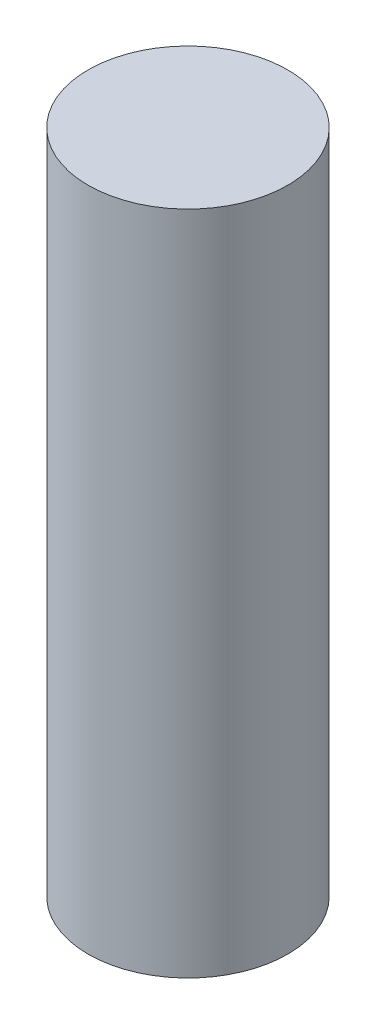
ISO-10303-21;
HEADER;
FILE_DESCRIPTION(('STEP AP214'),'2;1');
FILE_NAME('part.step','',(''),(''),'','','');
FILE_SCHEMA(('AUTOMOTIVE_DESIGN { 1 0 10303 214 1 1 1 1 }'));
ENDSEC;
DATA;
#1=APPLICATION_CONTEXT('core data for automotive mechanical design processes');
#2=APPLICATION_PROTOCOL_DEFINITION('international standard','automotive_design',2000,#1);
#3=PRODUCT_CONTEXT('',#1,'mechanical');
#4=PRODUCT('Part','Part','',(#3));
#5=PRODUCT_RELATED_PRODUCT_CATEGORY('part','',(#4));
#6=PRODUCT_DEFINITION_FORMATION('','',#4);
#7=PRODUCT_DEFINITION_CONTEXT('part definition',#1,'design');
#8=PRODUCT_DEFINITION('design','',#6,#7);
#9=PRODUCT_DEFINITION_SHAPE('','',#8);
#10=(LENGTH_UNIT() NAMED_UNIT(*) SI_UNIT(.MILLI.,.METRE.));
#11=(NAMED_UNIT(*) PLANE_ANGLE_UNIT() SI_UNIT($,.RADIAN.));
#12=(NAMED_UNIT(*) SI_UNIT($,.STERADIAN.) SOLID_ANGLE_UNIT());
#13=UNCERTAINTY_MEASURE_WITH_UNIT(LENGTH_MEASURE(1.E-05),#10,'distance_accuracy_value','');
#14=(GEOMETRIC_REPRESENTATION_CONTEXT(3) GLOBAL_UNCERTAINTY_ASSIGNED_CONTEXT((#13)) GLOBAL_UNIT_ASSIGNED_CONTEXT((#10,
#11,#12)) REPRESENTATION_CONTEXT('',''));
#15=CARTESIAN_POINT('',(0.,0.,0.));
#16=DIRECTION('',(0.,0.,1.));
#17=DIRECTION('',(1.,0.,0.));
#18=AXIS2_PLACEMENT_3D('',#15,#16,#17);
#19=CARTESIAN_POINT('',(0.,5.,0.));
#20=DIRECTION('',(0.,-1.,0.));
#21=DIRECTION('',(0.,0.,-1.));
#22=AXIS2_PLACEMENT_3D('',#19,#20,#21);
#23=CYLINDRICAL_SURFACE('',#22,0.75);
#24=CARTESIAN_POINT('',(0.,5.,0.));
#25=DIRECTION('',(0.,1.,0.));
#26=DIRECTION('',(0.,0.,1.));
#27=AXIS2_PLACEMENT_3D('',#24,#25,#26);
#28=CIRCLE('',#27,0.75);
#29=CARTESIAN_POINT('',(0.,5.,0.75));
#30=VERTEX_POINT('',#29);
#31=EDGE_CURVE('E10',#30,#30,#28,.T.);
#32=ORIENTED_EDGE('',*,*,#31,.F.);
#33=EDGE_LOOP('',(#32));
#34=FACE_BOUND('',#33,.T.);
#35=CARTESIAN_POINT('',(0.,0.,0.));
#36=DIRECTION('',(0.,1.,0.));
#37=DIRECTION('',(0.,0.,1.));
#38=AXIS2_PLACEMENT_3D('',#35,#36,#37);
#39=CIRCLE('',#38,0.75);
#40=CARTESIAN_POINT('',(0.,0.,0.75));
#41=VERTEX_POINT('',#40);
#42=EDGE_CURVE('E33',#41,#41,#39,.T.);
#43=ORIENTED_EDGE('',*,*,#42,.T.);
#44=EDGE_LOOP('',(#43));
#45=FACE_BOUND('',#44,.T.);
#46=ADVANCED_FACE('F30',(#34,#45),#23,.T.);
#47=CARTESIAN_POINT('',(0.,5.,0.));
#48=DIRECTION('',(0.,1.,0.));
#49=DIRECTION('',(0.,0.,1.));
#50=AXIS2_PLACEMENT_3D('',#47,#48,#49);
#51=PLANE('',#50);
#52=ORIENTED_EDGE('',*,*,#31,.T.);
#53=EDGE_LOOP('',(#52));
#54=FACE_BOUND('',#53,.T.);
#55=ADVANCED_FACE('F45',(#54),#51,.T.);
#56=CARTESIAN_POINT('',(0.,0.,0.));
#57=DIRECTION('',(0.,1.,0.));
#58=DIRECTION('',(0.,0.,1.));
#59=AXIS2_PLACEMENT_3D('',#56,#57,#58);
#60=PLANE('',#59);
#61=ORIENTED_EDGE('',*,*,#42,.F.);
#62=EDGE_LOOP('',(#61));
#63=FACE_BOUND('',#62,.T.);
#64=ADVANCED_FACE('F43',(#63),#60,.F.);
#65=CLOSED_SHELL('',(#46,#55,#64));
#66=MANIFOLD_SOLID_BREP('B2',#65);
#67=ADVANCED_BREP_SHAPE_REPRESENTATION('',(#18,#66),#14);
#68=SHAPE_DEFINITION_REPRESENTATION(#9,#67);
ENDSEC;
END-ISO-10303-21;
